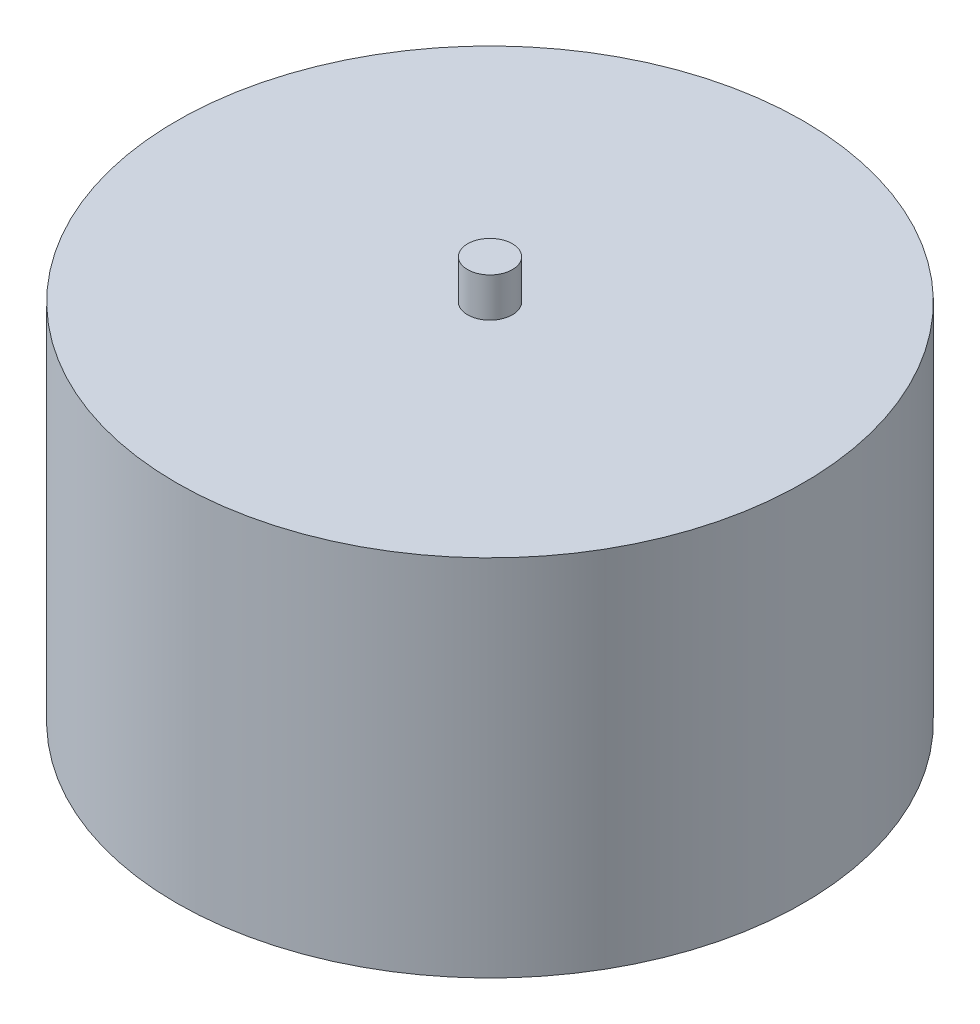
ISO-10303-21;
HEADER;
FILE_DESCRIPTION(('STEP AP214'),'2;1');
FILE_NAME('part.step','',(''),(''),'','','');
FILE_SCHEMA(('AUTOMOTIVE_DESIGN { 1 0 10303 214 1 1 1 1 }'));
ENDSEC;
DATA;
#1=APPLICATION_CONTEXT('core data for automotive mechanical design processes');
#2=APPLICATION_PROTOCOL_DEFINITION('international standard','automotive_design',2000,#1);
#3=PRODUCT_CONTEXT('',#1,'mechanical');
#4=PRODUCT('Part','Part','',(#3));
#5=PRODUCT_RELATED_PRODUCT_CATEGORY('part','',(#4));
#6=PRODUCT_DEFINITION_FORMATION('','',#4);
#7=PRODUCT_DEFINITION_CONTEXT('part definition',#1,'design');
#8=PRODUCT_DEFINITION('design','',#6,#7);
#9=PRODUCT_DEFINITION_SHAPE('','',#8);
#10=(LENGTH_UNIT() NAMED_UNIT(*) SI_UNIT(.MILLI.,.METRE.));
#11=(NAMED_UNIT(*) PLANE_ANGLE_UNIT() SI_UNIT($,.RADIAN.));
#12=(NAMED_UNIT(*) SI_UNIT($,.STERADIAN.) SOLID_ANGLE_UNIT());
#13=UNCERTAINTY_MEASURE_WITH_UNIT(LENGTH_MEASURE(1.E-05),#10,'distance_accuracy_value','');
#14=(GEOMETRIC_REPRESENTATION_CONTEXT(3) GLOBAL_UNCERTAINTY_ASSIGNED_CONTEXT((#13)) GLOBAL_UNIT_ASSIGNED_CONTEXT((#10,
#11,#12)) REPRESENTATION_CONTEXT('',''));
#15=CARTESIAN_POINT('',(0.,0.,0.));
#16=DIRECTION('',(0.,0.,1.));
#17=DIRECTION('',(1.,0.,0.));
#18=AXIS2_PLACEMENT_3D('',#15,#16,#17);
#19=CARTESIAN_POINT('',(0.,32.5,0.));
#20=DIRECTION('',(0.,-1.,0.));
#21=DIRECTION('',(0.,0.,-1.));
#22=AXIS2_PLACEMENT_3D('',#19,#20,#21);
#23=CYLINDRICAL_SURFACE('',#22,28.);
#24=CARTESIAN_POINT('',(0.,32.5,0.));
#25=DIRECTION('',(0.,1.,0.));
#26=DIRECTION('',(0.,0.,1.));
#27=AXIS2_PLACEMENT_3D('',#24,#25,#26);
#28=CIRCLE('',#27,28.);
#29=CARTESIAN_POINT('',(0.,32.5,28.));
#30=VERTEX_POINT('',#29);
#31=EDGE_CURVE('E10',#30,#30,#28,.T.);
#32=ORIENTED_EDGE('',*,*,#31,.F.);
#33=EDGE_LOOP('',(#32));
#34=FACE_BOUND('',#33,.T.);
#35=CARTESIAN_POINT('',(0.,0.,0.));
#36=DIRECTION('',(0.,1.,0.));
#37=DIRECTION('',(0.,0.,1.));
#38=AXIS2_PLACEMENT_3D('',#35,#36,#37);
#39=CIRCLE('',#38,28.);
#40=CARTESIAN_POINT('',(0.,0.,28.));
#41=VERTEX_POINT('',#40);
#42=EDGE_CURVE('E40',#41,#41,#39,.T.);
#43=ORIENTED_EDGE('',*,*,#42,.T.);
#44=EDGE_LOOP('',(#43));
#45=FACE_BOUND('',#44,.T.);
#46=ADVANCED_FACE('F37',(#34,#45),#23,.T.);
#47=CARTESIAN_POINT('',(0.,32.5,0.));
#48=DIRECTION('',(0.,1.,0.));
#49=DIRECTION('',(0.,0.,1.));
#50=AXIS2_PLACEMENT_3D('',#47,#48,#49);
#51=PLANE('',#50);
#52=CARTESIAN_POINT('',(0.,32.5,0.));
#53=DIRECTION('',(0.,1.,0.));
#54=DIRECTION('',(0.,0.,1.));
#55=AXIS2_PLACEMENT_3D('',#52,#53,#54);
#56=CIRCLE('',#55,2.);
#57=CARTESIAN_POINT('',(0.,32.5,2.));
#58=VERTEX_POINT('',#57);
#59=EDGE_CURVE('E51',#58,#58,#56,.T.);
#60=ORIENTED_EDGE('',*,*,#59,.F.);
#61=EDGE_LOOP('',(#60));
#62=FACE_BOUND('',#61,.T.);
#63=ORIENTED_EDGE('',*,*,#31,.T.);
#64=EDGE_LOOP('',(#63));
#65=FACE_BOUND('',#64,.T.);
#66=ADVANCED_FACE('F68',(#62,#65),#51,.T.);
#67=CARTESIAN_POINT('',(0.,0.,0.));
#68=DIRECTION('',(0.,1.,0.));
#69=DIRECTION('',(0.,0.,1.));
#70=AXIS2_PLACEMENT_3D('',#67,#68,#69);
#71=PLANE('',#70);
#72=ORIENTED_EDGE('',*,*,#42,.F.);
#73=EDGE_LOOP('',(#72));
#74=FACE_BOUND('',#73,.T.);
#75=ADVANCED_FACE('F64',(#74),#71,.F.);
#76=CARTESIAN_POINT('',(0.,36.,0.));
#77=DIRECTION('',(0.,-1.,0.));
#78=DIRECTION('',(0.,0.,-1.));
#79=AXIS2_PLACEMENT_3D('',#76,#77,#78);
#80=CYLINDRICAL_SURFACE('',#79,2.);
#81=CARTESIAN_POINT('',(0.,36.,0.));
#82=DIRECTION('',(0.,1.,0.));
#83=DIRECTION('',(0.,0.,1.));
#84=AXIS2_PLACEMENT_3D('',#81,#82,#83);
#85=CIRCLE('',#84,2.);
#86=CARTESIAN_POINT('',(0.,36.,2.));
#87=VERTEX_POINT('',#86);
#88=EDGE_CURVE('E49',#87,#87,#85,.T.);
#89=ORIENTED_EDGE('',*,*,#88,.F.);
#90=EDGE_LOOP('',(#89));
#91=FACE_BOUND('',#90,.T.);
#92=ORIENTED_EDGE('',*,*,#59,.T.);
#93=EDGE_LOOP('',(#92));
#94=FACE_BOUND('',#93,.T.);
#95=ADVANCED_FACE('F61',(#91,#94),#80,.T.);
#96=CARTESIAN_POINT('',(0.,36.,0.));
#97=DIRECTION('',(0.,1.,0.));
#98=DIRECTION('',(0.,0.,1.));
#99=AXIS2_PLACEMENT_3D('',#96,#97,#98);
#100=PLANE('',#99);
#101=ORIENTED_EDGE('',*,*,#88,.T.);
#102=EDGE_LOOP('',(#101));
#103=FACE_BOUND('',#102,.T.);
#104=ADVANCED_FACE('F59',(#103),#100,.T.);
#105=CLOSED_SHELL('',(#46,#66,#75,#95,#104));
#106=MANIFOLD_SOLID_BREP('B2',#105);
#107=ADVANCED_BREP_SHAPE_REPRESENTATION('',(#18,#106),#14);
#108=SHAPE_DEFINITION_REPRESENTATION(#9,#107);
ENDSEC;
END-ISO-10303-21;
